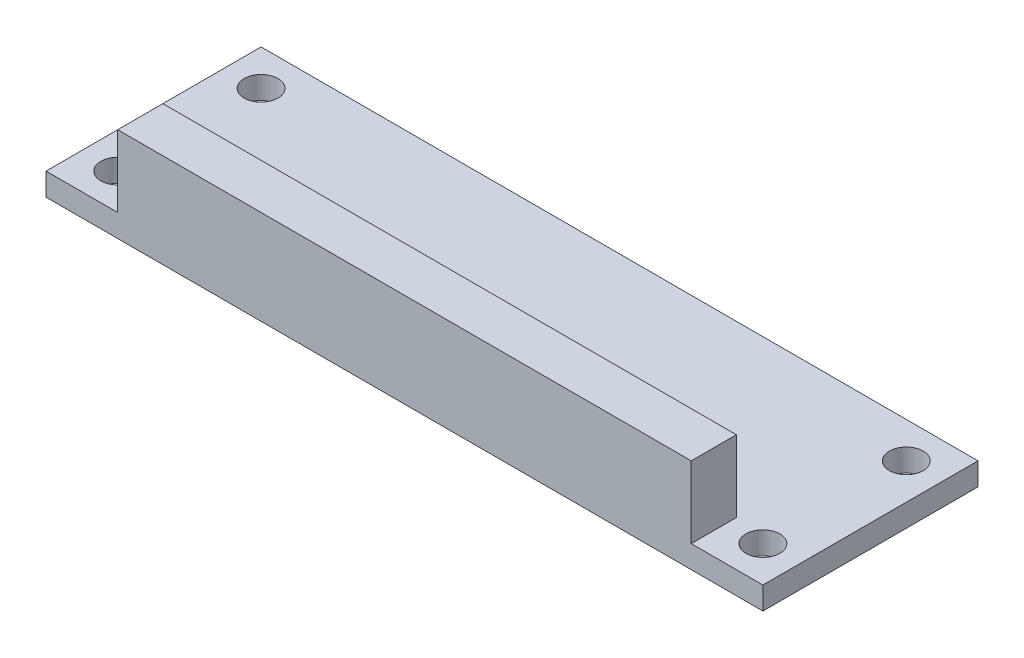
ISO-10303-21;
HEADER;
FILE_DESCRIPTION(('STEP AP214'),'2;1');
FILE_NAME('part.step','',(''),(''),'','','');
FILE_SCHEMA(('AUTOMOTIVE_DESIGN { 1 0 10303 214 1 1 1 1 }'));
ENDSEC;
DATA;
#1=APPLICATION_CONTEXT('core data for automotive mechanical design processes');
#2=APPLICATION_PROTOCOL_DEFINITION('international standard','automotive_design',2000,#1);
#3=PRODUCT_CONTEXT('',#1,'mechanical');
#4=PRODUCT('Part','Part','',(#3));
#5=PRODUCT_RELATED_PRODUCT_CATEGORY('part','',(#4));
#6=PRODUCT_DEFINITION_FORMATION('','',#4);
#7=PRODUCT_DEFINITION_CONTEXT('part definition',#1,'design');
#8=PRODUCT_DEFINITION('design','',#6,#7);
#9=PRODUCT_DEFINITION_SHAPE('','',#8);
#10=(LENGTH_UNIT() NAMED_UNIT(*) SI_UNIT(.MILLI.,.METRE.));
#11=(NAMED_UNIT(*) PLANE_ANGLE_UNIT() SI_UNIT($,.RADIAN.));
#12=(NAMED_UNIT(*) SI_UNIT($,.STERADIAN.) SOLID_ANGLE_UNIT());
#13=UNCERTAINTY_MEASURE_WITH_UNIT(LENGTH_MEASURE(1.E-05),#10,'distance_accuracy_value','');
#14=(GEOMETRIC_REPRESENTATION_CONTEXT(3) GLOBAL_UNCERTAINTY_ASSIGNED_CONTEXT((#13)) GLOBAL_UNIT_ASSIGNED_CONTEXT((#10,
#11,#12)) REPRESENTATION_CONTEXT('',''));
#15=CARTESIAN_POINT('',(0.,0.,0.));
#16=DIRECTION('',(0.,0.,1.));
#17=DIRECTION('',(1.,0.,0.));
#18=AXIS2_PLACEMENT_3D('',#15,#16,#17);
#19=CARTESIAN_POINT('',(0.,2.,0.));
#20=DIRECTION('',(0.,-1.,0.));
#21=DIRECTION('',(0.,0.,-1.));
#22=AXIS2_PLACEMENT_3D('',#19,#20,#21);
#23=PLANE('',#22);
#24=CARTESIAN_POINT('',(-28.575,2.,-6.34999999999999));
#25=DIRECTION('',(0.,1.,0.));
#26=DIRECTION('',(0.,0.,-1.));
#27=AXIS2_PLACEMENT_3D('',#24,#25,#26);
#28=CIRCLE('',#27,1.5);
#29=CARTESIAN_POINT('',(-28.575,2.,-7.85));
#30=VERTEX_POINT('',#29);
#31=EDGE_CURVE('E125',#30,#30,#28,.T.);
#32=ORIENTED_EDGE('',*,*,#31,.F.);
#33=EDGE_LOOP('',(#32));
#34=FACE_BOUND('',#33,.T.);
#35=CARTESIAN_POINT('',(-28.575,2.,6.34999999999999));
#36=DIRECTION('',(0.,1.,0.));
#37=DIRECTION('',(0.,0.,-1.));
#38=AXIS2_PLACEMENT_3D('',#35,#36,#37);
#39=CIRCLE('',#38,1.5);
#40=CARTESIAN_POINT('',(-28.575,2.,4.84999999999999));
#41=VERTEX_POINT('',#40);
#42=EDGE_CURVE('E134',#41,#41,#39,.T.);
#43=ORIENTED_EDGE('',*,*,#42,.F.);
#44=EDGE_LOOP('',(#43));
#45=FACE_BOUND('',#44,.T.);
#46=CARTESIAN_POINT('',(28.575,2.,6.35000000000001));
#47=DIRECTION('',(0.,1.,0.));
#48=DIRECTION('',(0.,0.,1.));
#49=AXIS2_PLACEMENT_3D('',#46,#47,#48);
#50=CIRCLE('',#49,1.5);
#51=CARTESIAN_POINT('',(28.575,2.,7.85000000000001));
#52=VERTEX_POINT('',#51);
#53=EDGE_CURVE('E140',#52,#52,#50,.T.);
#54=ORIENTED_EDGE('',*,*,#53,.F.);
#55=EDGE_LOOP('',(#54));
#56=FACE_BOUND('',#55,.T.);
#57=CARTESIAN_POINT('',(28.575,2.,-6.34999999999999));
#58=DIRECTION('',(0.,1.,0.));
#59=DIRECTION('',(0.,0.,1.));
#60=AXIS2_PLACEMENT_3D('',#57,#58,#59);
#61=CIRCLE('',#60,1.5);
#62=CARTESIAN_POINT('',(28.575,2.,-4.84999999999999));
#63=VERTEX_POINT('',#62);
#64=EDGE_CURVE('E146',#63,#63,#61,.T.);
#65=ORIENTED_EDGE('',*,*,#64,.F.);
#66=EDGE_LOOP('',(#65));
#67=FACE_BOUND('',#66,.T.);
#68=DIRECTION('',(0.,0.,1.));
#69=VECTOR('',#68,1.);
#70=CARTESIAN_POINT('',(-25.4,2.,9.525));
#71=LINE('',#70,#69);
#72=CARTESIAN_POINT('',(-25.4,2.,5.525));
#73=VERTEX_POINT('',#72);
#74=CARTESIAN_POINT('',(-25.4,2.,9.525));
#75=VERTEX_POINT('',#74);
#76=EDGE_CURVE('E50',#73,#75,#71,.T.);
#77=ORIENTED_EDGE('',*,*,#76,.F.);
#78=DIRECTION('',(-1.,0.,0.));
#79=VECTOR('',#78,1.);
#80=CARTESIAN_POINT('',(-25.4,2.,5.525));
#81=LINE('',#80,#79);
#82=CARTESIAN_POINT('',(25.4,2.,5.525));
#83=VERTEX_POINT('',#82);
#84=EDGE_CURVE('E119',#83,#73,#81,.T.);
#85=ORIENTED_EDGE('',*,*,#84,.F.);
#86=DIRECTION('',(0.,0.,-1.));
#87=VECTOR('',#86,1.);
#88=CARTESIAN_POINT('',(25.4,2.,9.525));
#89=LINE('',#88,#87);
#90=CARTESIAN_POINT('',(25.4,2.,9.525));
#91=VERTEX_POINT('',#90);
#92=EDGE_CURVE('E56',#91,#83,#89,.T.);
#93=ORIENTED_EDGE('',*,*,#92,.F.);
#94=DIRECTION('',(1.,0.,0.));
#95=VECTOR('',#94,1.);
#96=CARTESIAN_POINT('',(-31.75,2.,9.525));
#97=LINE('',#96,#95);
#98=CARTESIAN_POINT('',(31.75,2.,9.525));
#99=VERTEX_POINT('',#98);
#100=EDGE_CURVE('E160',#91,#99,#97,.T.);
#101=ORIENTED_EDGE('',*,*,#100,.T.);
#102=DIRECTION('',(0.,0.,-1.));
#103=VECTOR('',#102,1.);
#104=CARTESIAN_POINT('',(31.75,2.,9.525));
#105=LINE('',#104,#103);
#106=CARTESIAN_POINT('',(31.75,2.,-9.525));
#107=VERTEX_POINT('',#106);
#108=EDGE_CURVE('E152',#99,#107,#105,.T.);
#109=ORIENTED_EDGE('',*,*,#108,.T.);
#110=DIRECTION('',(-1.,0.,0.));
#111=VECTOR('',#110,1.);
#112=CARTESIAN_POINT('',(-31.75,2.,-9.525));
#113=LINE('',#112,#111);
#114=CARTESIAN_POINT('',(-31.75,2.,-9.525));
#115=VERTEX_POINT('',#114);
#116=EDGE_CURVE('E155',#107,#115,#113,.T.);
#117=ORIENTED_EDGE('',*,*,#116,.T.);
#118=DIRECTION('',(0.,0.,1.));
#119=VECTOR('',#118,1.);
#120=CARTESIAN_POINT('',(-31.75,2.,9.525));
#121=LINE('',#120,#119);
#122=CARTESIAN_POINT('',(-31.75,2.,9.525));
#123=VERTEX_POINT('',#122);
#124=EDGE_CURVE('E158',#115,#123,#121,.T.);
#125=ORIENTED_EDGE('',*,*,#124,.T.);
#126=EDGE_CURVE('E161',#123,#75,#97,.T.);
#127=ORIENTED_EDGE('',*,*,#126,.T.);
#128=EDGE_LOOP('',(#77,#85,#93,#101,#109,#117,#125,#127));
#129=FACE_BOUND('',#128,.T.);
#130=ADVANCED_FACE('F35',(#34,#45,#56,#67,#129),#23,.F.);
#131=CARTESIAN_POINT('',(0.,0.,0.));
#132=DIRECTION('',(0.,-1.,0.));
#133=DIRECTION('',(0.,0.,-1.));
#134=AXIS2_PLACEMENT_3D('',#131,#132,#133);
#135=PLANE('',#134);
#136=CARTESIAN_POINT('',(-28.575,0.,6.34999999999999));
#137=DIRECTION('',(0.,1.,0.));
#138=DIRECTION('',(0.,0.,-1.));
#139=AXIS2_PLACEMENT_3D('',#136,#137,#138);
#140=CIRCLE('',#139,1.5);
#141=CARTESIAN_POINT('',(-28.575,0.,4.84999999999999));
#142=VERTEX_POINT('',#141);
#143=EDGE_CURVE('E132',#142,#142,#140,.T.);
#144=ORIENTED_EDGE('',*,*,#143,.T.);
#145=EDGE_LOOP('',(#144));
#146=FACE_BOUND('',#145,.T.);
#147=CARTESIAN_POINT('',(28.575,0.,-6.34999999999999));
#148=DIRECTION('',(0.,1.,0.));
#149=DIRECTION('',(0.,0.,1.));
#150=AXIS2_PLACEMENT_3D('',#147,#148,#149);
#151=CIRCLE('',#150,1.5);
#152=CARTESIAN_POINT('',(28.575,0.,-4.84999999999999));
#153=VERTEX_POINT('',#152);
#154=EDGE_CURVE('E143',#153,#153,#151,.T.);
#155=ORIENTED_EDGE('',*,*,#154,.T.);
#156=EDGE_LOOP('',(#155));
#157=FACE_BOUND('',#156,.T.);
#158=DIRECTION('',(0.,0.,-1.));
#159=VECTOR('',#158,1.);
#160=CARTESIAN_POINT('',(31.75,0.,9.525));
#161=LINE('',#160,#159);
#162=CARTESIAN_POINT('',(31.75,0.,9.525));
#163=VERTEX_POINT('',#162);
#164=CARTESIAN_POINT('',(31.75,0.,-9.525));
#165=VERTEX_POINT('',#164);
#166=EDGE_CURVE('E149',#163,#165,#161,.T.);
#167=ORIENTED_EDGE('',*,*,#166,.F.);
#168=DIRECTION('',(1.,0.,0.));
#169=VECTOR('',#168,1.);
#170=CARTESIAN_POINT('',(-31.75,0.,9.525));
#171=LINE('',#170,#169);
#172=CARTESIAN_POINT('',(-31.75,0.,9.525));
#173=VERTEX_POINT('',#172);
#174=EDGE_CURVE('E156',#173,#163,#171,.T.);
#175=ORIENTED_EDGE('',*,*,#174,.F.);
#176=DIRECTION('',(0.,0.,1.));
#177=VECTOR('',#176,1.);
#178=CARTESIAN_POINT('',(-31.75,0.,9.525));
#179=LINE('',#178,#177);
#180=CARTESIAN_POINT('',(-31.75,0.,-9.525));
#181=VERTEX_POINT('',#180);
#182=EDGE_CURVE('E168',#181,#173,#179,.T.);
#183=ORIENTED_EDGE('',*,*,#182,.F.);
#184=DIRECTION('',(-1.,0.,0.));
#185=VECTOR('',#184,1.);
#186=CARTESIAN_POINT('',(-31.75,0.,-9.525));
#187=LINE('',#186,#185);
#188=EDGE_CURVE('E166',#165,#181,#187,.T.);
#189=ORIENTED_EDGE('',*,*,#188,.F.);
#190=EDGE_LOOP('',(#167,#175,#183,#189));
#191=FACE_BOUND('',#190,.T.);
#192=CARTESIAN_POINT('',(28.575,0.,6.35000000000001));
#193=DIRECTION('',(0.,1.,0.));
#194=DIRECTION('',(0.,0.,1.));
#195=AXIS2_PLACEMENT_3D('',#192,#193,#194);
#196=CIRCLE('',#195,1.5);
#197=CARTESIAN_POINT('',(28.575,0.,7.85000000000001));
#198=VERTEX_POINT('',#197);
#199=EDGE_CURVE('E137',#198,#198,#196,.T.);
#200=ORIENTED_EDGE('',*,*,#199,.T.);
#201=EDGE_LOOP('',(#200));
#202=FACE_BOUND('',#201,.T.);
#203=CARTESIAN_POINT('',(-28.575,0.,-6.34999999999999));
#204=DIRECTION('',(0.,1.,0.));
#205=DIRECTION('',(0.,0.,-1.));
#206=AXIS2_PLACEMENT_3D('',#203,#204,#205);
#207=CIRCLE('',#206,1.5);
#208=CARTESIAN_POINT('',(-28.575,0.,-7.85));
#209=VERTEX_POINT('',#208);
#210=EDGE_CURVE('E122',#209,#209,#207,.T.);
#211=ORIENTED_EDGE('',*,*,#210,.T.);
#212=EDGE_LOOP('',(#211));
#213=FACE_BOUND('',#212,.T.);
#214=ADVANCED_FACE('F186',(#146,#157,#191,#202,#213),#135,.T.);
#215=CARTESIAN_POINT('',(31.75,2.,9.525));
#216=DIRECTION('',(-1.,0.,0.));
#217=DIRECTION('',(0.,0.,1.));
#218=AXIS2_PLACEMENT_3D('',#215,#216,#217);
#219=PLANE('',#218);
#220=ORIENTED_EDGE('',*,*,#166,.T.);
#221=DIRECTION('',(0.,-1.,0.));
#222=VECTOR('',#221,1.);
#223=CARTESIAN_POINT('',(31.75,2.,-9.525));
#224=LINE('',#223,#222);
#225=EDGE_CURVE('E11',#107,#165,#224,.T.);
#226=ORIENTED_EDGE('',*,*,#225,.F.);
#227=ORIENTED_EDGE('',*,*,#108,.F.);
#228=DIRECTION('',(0.,-1.,0.));
#229=VECTOR('',#228,1.);
#230=CARTESIAN_POINT('',(31.75,2.,9.525));
#231=LINE('',#230,#229);
#232=EDGE_CURVE('E163',#99,#163,#231,.T.);
#233=ORIENTED_EDGE('',*,*,#232,.T.);
#234=EDGE_LOOP('',(#220,#226,#227,#233));
#235=FACE_BOUND('',#234,.T.);
#236=ADVANCED_FACE('F37',(#235),#219,.F.);
#237=CARTESIAN_POINT('',(-31.75,2.,-9.525));
#238=DIRECTION('',(0.,0.,1.));
#239=DIRECTION('',(1.,0.,0.));
#240=AXIS2_PLACEMENT_3D('',#237,#238,#239);
#241=PLANE('',#240);
#242=ORIENTED_EDGE('',*,*,#188,.T.);
#243=DIRECTION('',(0.,-1.,0.));
#244=VECTOR('',#243,1.);
#245=CARTESIAN_POINT('',(-31.75,2.,-9.525));
#246=LINE('',#245,#244);
#247=EDGE_CURVE('E43',#115,#181,#246,.T.);
#248=ORIENTED_EDGE('',*,*,#247,.F.);
#249=ORIENTED_EDGE('',*,*,#116,.F.);
#250=ORIENTED_EDGE('',*,*,#225,.T.);
#251=EDGE_LOOP('',(#242,#248,#249,#250));
#252=FACE_BOUND('',#251,.T.);
#253=ADVANCED_FACE('F230',(#252),#241,.F.);
#254=CARTESIAN_POINT('',(-31.75,2.,9.525));
#255=DIRECTION('',(1.,0.,0.));
#256=DIRECTION('',(0.,0.,-1.));
#257=AXIS2_PLACEMENT_3D('',#254,#255,#256);
#258=PLANE('',#257);
#259=ORIENTED_EDGE('',*,*,#182,.T.);
#260=DIRECTION('',(0.,-1.,0.));
#261=VECTOR('',#260,1.);
#262=CARTESIAN_POINT('',(-31.75,2.,9.525));
#263=LINE('',#262,#261);
#264=EDGE_CURVE('E173',#123,#173,#263,.T.);
#265=ORIENTED_EDGE('',*,*,#264,.F.);
#266=ORIENTED_EDGE('',*,*,#124,.F.);
#267=ORIENTED_EDGE('',*,*,#247,.T.);
#268=EDGE_LOOP('',(#259,#265,#266,#267));
#269=FACE_BOUND('',#268,.T.);
#270=ADVANCED_FACE('F180',(#269),#258,.F.);
#271=CARTESIAN_POINT('',(-31.75,2.,9.525));
#272=DIRECTION('',(0.,0.,-1.));
#273=DIRECTION('',(-1.,0.,0.));
#274=AXIS2_PLACEMENT_3D('',#271,#272,#273);
#275=PLANE('',#274);
#276=ORIENTED_EDGE('',*,*,#174,.T.);
#277=ORIENTED_EDGE('',*,*,#232,.F.);
#278=ORIENTED_EDGE('',*,*,#100,.F.);
#279=DIRECTION('',(0.,-1.,0.));
#280=VECTOR('',#279,1.);
#281=CARTESIAN_POINT('',(25.4,8.35,9.525));
#282=LINE('',#281,#280);
#283=CARTESIAN_POINT('',(25.4,8.35,9.525));
#284=VERTEX_POINT('',#283);
#285=EDGE_CURVE('E106',#284,#91,#282,.T.);
#286=ORIENTED_EDGE('',*,*,#285,.F.);
#287=DIRECTION('',(1.,0.,0.));
#288=VECTOR('',#287,1.);
#289=CARTESIAN_POINT('',(-25.4,8.35,9.525));
#290=LINE('',#289,#288);
#291=CARTESIAN_POINT('',(-25.4,8.35,9.525));
#292=VERTEX_POINT('',#291);
#293=EDGE_CURVE('E99',#292,#284,#290,.T.);
#294=ORIENTED_EDGE('',*,*,#293,.F.);
#295=DIRECTION('',(0.,-1.,0.));
#296=VECTOR('',#295,1.);
#297=CARTESIAN_POINT('',(-25.4,8.35,9.525));
#298=LINE('',#297,#296);
#299=EDGE_CURVE('E104',#292,#75,#298,.T.);
#300=ORIENTED_EDGE('',*,*,#299,.T.);
#301=ORIENTED_EDGE('',*,*,#126,.F.);
#302=ORIENTED_EDGE('',*,*,#264,.T.);
#303=EDGE_LOOP('',(#276,#277,#278,#286,#294,#300,#301,#302));
#304=FACE_BOUND('',#303,.T.);
#305=ADVANCED_FACE('F101',(#304),#275,.F.);
#306=CARTESIAN_POINT('',(28.575,2.,-6.34999999999999));
#307=DIRECTION('',(0.,-1.,0.));
#308=DIRECTION('',(0.,0.,-1.));
#309=AXIS2_PLACEMENT_3D('',#306,#307,#308);
#310=CYLINDRICAL_SURFACE('',#309,1.5);
#311=ORIENTED_EDGE('',*,*,#64,.T.);
#312=EDGE_LOOP('',(#311));
#313=FACE_BOUND('',#312,.T.);
#314=ORIENTED_EDGE('',*,*,#154,.F.);
#315=EDGE_LOOP('',(#314));
#316=FACE_BOUND('',#315,.T.);
#317=ADVANCED_FACE('F224',(#313,#316),#310,.F.);
#318=CARTESIAN_POINT('',(28.575,2.,6.35000000000001));
#319=DIRECTION('',(0.,-1.,0.));
#320=DIRECTION('',(0.,0.,-1.));
#321=AXIS2_PLACEMENT_3D('',#318,#319,#320);
#322=CYLINDRICAL_SURFACE('',#321,1.5);
#323=ORIENTED_EDGE('',*,*,#53,.T.);
#324=EDGE_LOOP('',(#323));
#325=FACE_BOUND('',#324,.T.);
#326=ORIENTED_EDGE('',*,*,#199,.F.);
#327=EDGE_LOOP('',(#326));
#328=FACE_BOUND('',#327,.T.);
#329=ADVANCED_FACE('F271',(#325,#328),#322,.F.);
#330=CARTESIAN_POINT('',(-28.575,2.,6.34999999999999));
#331=DIRECTION('',(0.,-1.,0.));
#332=DIRECTION('',(0.,0.,-1.));
#333=AXIS2_PLACEMENT_3D('',#330,#331,#332);
#334=CYLINDRICAL_SURFACE('',#333,1.5);
#335=ORIENTED_EDGE('',*,*,#42,.T.);
#336=EDGE_LOOP('',(#335));
#337=FACE_BOUND('',#336,.T.);
#338=ORIENTED_EDGE('',*,*,#143,.F.);
#339=EDGE_LOOP('',(#338));
#340=FACE_BOUND('',#339,.T.);
#341=ADVANCED_FACE('F279',(#337,#340),#334,.F.);
#342=CARTESIAN_POINT('',(-28.575,2.,-6.34999999999999));
#343=DIRECTION('',(0.,-1.,0.));
#344=DIRECTION('',(0.,0.,-1.));
#345=AXIS2_PLACEMENT_3D('',#342,#343,#344);
#346=CYLINDRICAL_SURFACE('',#345,1.5);
#347=ORIENTED_EDGE('',*,*,#31,.T.);
#348=EDGE_LOOP('',(#347));
#349=FACE_BOUND('',#348,.T.);
#350=ORIENTED_EDGE('',*,*,#210,.F.);
#351=EDGE_LOOP('',(#350));
#352=FACE_BOUND('',#351,.T.);
#353=ADVANCED_FACE('F287',(#349,#352),#346,.F.);
#354=CARTESIAN_POINT('',(-25.4,8.35,9.525));
#355=DIRECTION('',(1.,0.,0.));
#356=DIRECTION('',(0.,0.,-1.));
#357=AXIS2_PLACEMENT_3D('',#354,#355,#356);
#358=PLANE('',#357);
#359=ORIENTED_EDGE('',*,*,#76,.T.);
#360=ORIENTED_EDGE('',*,*,#299,.F.);
#361=DIRECTION('',(0.,0.,1.));
#362=VECTOR('',#361,1.);
#363=CARTESIAN_POINT('',(-25.4,8.35,9.525));
#364=LINE('',#363,#362);
#365=CARTESIAN_POINT('',(-25.4,8.35,5.525));
#366=VERTEX_POINT('',#365);
#367=EDGE_CURVE('E110',#366,#292,#364,.T.);
#368=ORIENTED_EDGE('',*,*,#367,.F.);
#369=DIRECTION('',(0.,-1.,0.));
#370=VECTOR('',#369,1.);
#371=CARTESIAN_POINT('',(-25.4,8.35,5.525));
#372=LINE('',#371,#370);
#373=EDGE_CURVE('E197',#366,#73,#372,.T.);
#374=ORIENTED_EDGE('',*,*,#373,.T.);
#375=EDGE_LOOP('',(#359,#360,#368,#374));
#376=FACE_BOUND('',#375,.T.);
#377=ADVANCED_FACE('F121',(#376),#358,.F.);
#378=CARTESIAN_POINT('',(25.4,8.35,9.525));
#379=DIRECTION('',(-1.,0.,0.));
#380=DIRECTION('',(0.,0.,1.));
#381=AXIS2_PLACEMENT_3D('',#378,#379,#380);
#382=PLANE('',#381);
#383=ORIENTED_EDGE('',*,*,#92,.T.);
#384=DIRECTION('',(0.,-1.,0.));
#385=VECTOR('',#384,1.);
#386=CARTESIAN_POINT('',(25.4,8.35,5.525));
#387=LINE('',#386,#385);
#388=CARTESIAN_POINT('',(25.4,8.35,5.525));
#389=VERTEX_POINT('',#388);
#390=EDGE_CURVE('E127',#389,#83,#387,.T.);
#391=ORIENTED_EDGE('',*,*,#390,.F.);
#392=DIRECTION('',(0.,0.,-1.));
#393=VECTOR('',#392,1.);
#394=CARTESIAN_POINT('',(25.4,8.35,9.525));
#395=LINE('',#394,#393);
#396=EDGE_CURVE('E109',#284,#389,#395,.T.);
#397=ORIENTED_EDGE('',*,*,#396,.F.);
#398=ORIENTED_EDGE('',*,*,#285,.T.);
#399=EDGE_LOOP('',(#383,#391,#397,#398));
#400=FACE_BOUND('',#399,.T.);
#401=ADVANCED_FACE('F193',(#400),#382,.F.);
#402=CARTESIAN_POINT('',(-25.4,8.35,5.525));
#403=DIRECTION('',(0.,0.,1.));
#404=DIRECTION('',(1.,0.,0.));
#405=AXIS2_PLACEMENT_3D('',#402,#403,#404);
#406=PLANE('',#405);
#407=ORIENTED_EDGE('',*,*,#84,.T.);
#408=ORIENTED_EDGE('',*,*,#373,.F.);
#409=DIRECTION('',(-1.,0.,0.));
#410=VECTOR('',#409,1.);
#411=CARTESIAN_POINT('',(-25.4,8.35,5.525));
#412=LINE('',#411,#410);
#413=EDGE_CURVE('E115',#389,#366,#412,.T.);
#414=ORIENTED_EDGE('',*,*,#413,.F.);
#415=ORIENTED_EDGE('',*,*,#390,.T.);
#416=EDGE_LOOP('',(#407,#408,#414,#415));
#417=FACE_BOUND('',#416,.T.);
#418=ADVANCED_FACE('F204',(#417),#406,.F.);
#419=CARTESIAN_POINT('',(0.,8.35,0.));
#420=DIRECTION('',(0.,-1.,0.));
#421=DIRECTION('',(0.,0.,-1.));
#422=AXIS2_PLACEMENT_3D('',#419,#420,#421);
#423=PLANE('',#422);
#424=ORIENTED_EDGE('',*,*,#367,.T.);
#425=ORIENTED_EDGE('',*,*,#293,.T.);
#426=ORIENTED_EDGE('',*,*,#396,.T.);
#427=ORIENTED_EDGE('',*,*,#413,.T.);
#428=EDGE_LOOP('',(#424,#425,#426,#427));
#429=FACE_BOUND('',#428,.T.);
#430=ADVANCED_FACE('F113',(#429),#423,.F.);
#431=CLOSED_SHELL('',(#130,#214,#236,#253,#270,#305,#317,#329,#341,#353,#377,#401,#418,#430));
#432=MANIFOLD_SOLID_BREP('B2',#431);
#433=ADVANCED_BREP_SHAPE_REPRESENTATION('',(#18,#432),#14);
#434=SHAPE_DEFINITION_REPRESENTATION(#9,#433);
ENDSEC;
END-ISO-10303-21;
